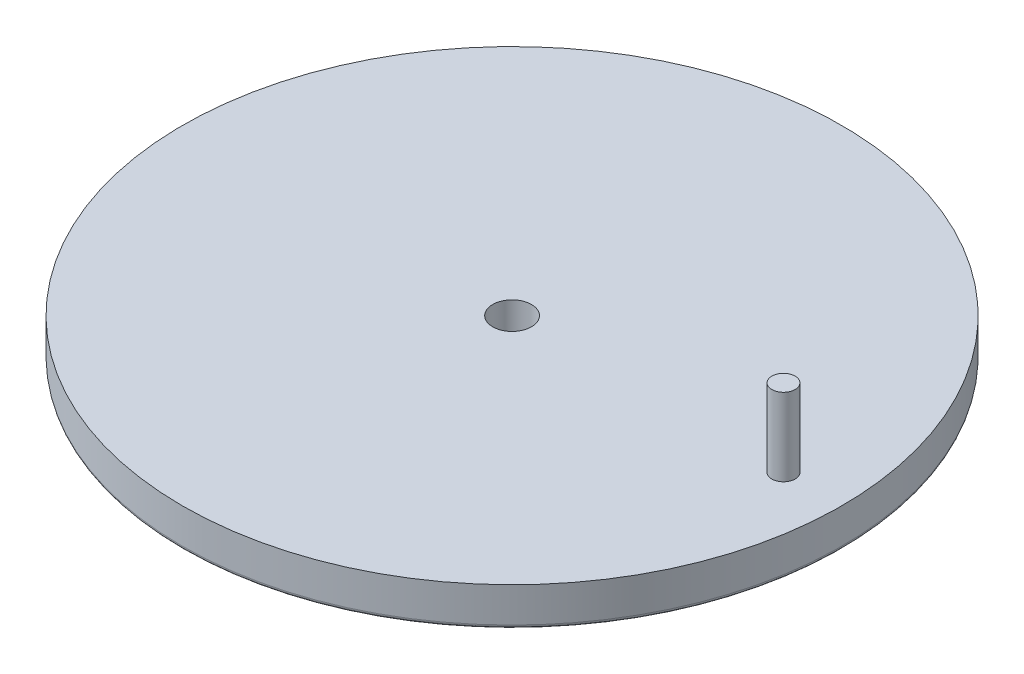
ISO-10303-21;
HEADER;
FILE_DESCRIPTION(('STEP AP214'),'2;1');
FILE_NAME('part.step','',(''),(''),'','','');
FILE_SCHEMA(('AUTOMOTIVE_DESIGN { 1 0 10303 214 1 1 1 1 }'));
ENDSEC;
DATA;
#1=APPLICATION_CONTEXT('core data for automotive mechanical design processes');
#2=APPLICATION_PROTOCOL_DEFINITION('international standard','automotive_design',2000,#1);
#3=PRODUCT_CONTEXT('',#1,'mechanical');
#4=PRODUCT('Part','Part','',(#3));
#5=PRODUCT_RELATED_PRODUCT_CATEGORY('part','',(#4));
#6=PRODUCT_DEFINITION_FORMATION('','',#4);
#7=PRODUCT_DEFINITION_CONTEXT('part definition',#1,'design');
#8=PRODUCT_DEFINITION('design','',#6,#7);
#9=PRODUCT_DEFINITION_SHAPE('','',#8);
#10=(LENGTH_UNIT() NAMED_UNIT(*) SI_UNIT(.MILLI.,.METRE.));
#11=(NAMED_UNIT(*) PLANE_ANGLE_UNIT() SI_UNIT($,.RADIAN.));
#12=(NAMED_UNIT(*) SI_UNIT($,.STERADIAN.) SOLID_ANGLE_UNIT());
#13=UNCERTAINTY_MEASURE_WITH_UNIT(LENGTH_MEASURE(1.E-05),#10,'distance_accuracy_value','');
#14=(GEOMETRIC_REPRESENTATION_CONTEXT(3) GLOBAL_UNCERTAINTY_ASSIGNED_CONTEXT((#13)) GLOBAL_UNIT_ASSIGNED_CONTEXT((#10,
#11,#12)) REPRESENTATION_CONTEXT('',''));
#15=CARTESIAN_POINT('',(0.,0.,0.));
#16=DIRECTION('',(0.,0.,1.));
#17=DIRECTION('',(1.,0.,0.));
#18=AXIS2_PLACEMENT_3D('',#15,#16,#17);
#19=CARTESIAN_POINT('',(0.,5.,0.));
#20=DIRECTION('',(0.,-1.,0.));
#21=DIRECTION('',(0.,0.,-1.));
#22=AXIS2_PLACEMENT_3D('',#19,#20,#21);
#23=CYLINDRICAL_SURFACE('',#22,42.5);
#24=CARTESIAN_POINT('',(0.,0.5,0.));
#25=DIRECTION('',(0.,1.,0.));
#26=DIRECTION('',(0.,0.,1.));
#27=AXIS2_PLACEMENT_3D('',#24,#25,#26);
#28=CIRCLE('',#27,42.5);
#29=CARTESIAN_POINT('',(0.,0.5,42.5));
#30=VERTEX_POINT('',#29);
#31=EDGE_CURVE('E43',#30,#30,#28,.T.);
#32=ORIENTED_EDGE('',*,*,#31,.T.);
#33=EDGE_LOOP('',(#32));
#34=FACE_BOUND('',#33,.T.);
#35=CARTESIAN_POINT('',(0.,5.,0.));
#36=DIRECTION('',(0.,1.,0.));
#37=DIRECTION('',(0.,0.,1.));
#38=AXIS2_PLACEMENT_3D('',#35,#36,#37);
#39=CIRCLE('',#38,42.5);
#40=CARTESIAN_POINT('',(0.,5.,42.5));
#41=VERTEX_POINT('',#40);
#42=EDGE_CURVE('E51',#41,#41,#39,.T.);
#43=ORIENTED_EDGE('',*,*,#42,.F.);
#44=EDGE_LOOP('',(#43));
#45=FACE_BOUND('',#44,.T.);
#46=ADVANCED_FACE('F36',(#34,#45),#23,.T.);
#47=CARTESIAN_POINT('',(0.,5.,0.));
#48=DIRECTION('',(0.,1.,0.));
#49=DIRECTION('',(0.,0.,1.));
#50=AXIS2_PLACEMENT_3D('',#47,#48,#49);
#51=PLANE('',#50);
#52=CARTESIAN_POINT('',(0.,5.,0.));
#53=DIRECTION('',(0.,1.,0.));
#54=DIRECTION('',(0.,0.,1.));
#55=AXIS2_PLACEMENT_3D('',#52,#53,#54);
#56=CIRCLE('',#55,2.5);
#57=CARTESIAN_POINT('',(0.,5.,2.5));
#58=VERTEX_POINT('',#57);
#59=EDGE_CURVE('E58',#58,#58,#56,.T.);
#60=ORIENTED_EDGE('',*,*,#59,.F.);
#61=EDGE_LOOP('',(#60));
#62=FACE_BOUND('',#61,.T.);
#63=CARTESIAN_POINT('',(35.,5.,0.));
#64=DIRECTION('',(0.,1.,0.));
#65=DIRECTION('',(0.,0.,1.));
#66=AXIS2_PLACEMENT_3D('',#63,#64,#65);
#67=CIRCLE('',#66,1.5);
#68=CARTESIAN_POINT('',(35.,5.,1.5));
#69=VERTEX_POINT('',#68);
#70=EDGE_CURVE('E57',#69,#69,#67,.T.);
#71=ORIENTED_EDGE('',*,*,#70,.F.);
#72=EDGE_LOOP('',(#71));
#73=FACE_BOUND('',#72,.T.);
#74=ORIENTED_EDGE('',*,*,#42,.T.);
#75=EDGE_LOOP('',(#74));
#76=FACE_BOUND('',#75,.T.);
#77=ADVANCED_FACE('F85',(#62,#73,#76),#51,.T.);
#78=CARTESIAN_POINT('',(0.,0.,0.));
#79=DIRECTION('',(0.,1.,0.));
#80=DIRECTION('',(0.,0.,1.));
#81=AXIS2_PLACEMENT_3D('',#78,#79,#80);
#82=PLANE('',#81);
#83=CARTESIAN_POINT('',(0.,0.,0.));
#84=DIRECTION('',(0.,1.,0.));
#85=DIRECTION('',(0.,0.,1.));
#86=AXIS2_PLACEMENT_3D('',#83,#84,#85);
#87=CIRCLE('',#86,42.);
#88=CARTESIAN_POINT('',(0.,0.,42.));
#89=VERTEX_POINT('',#88);
#90=EDGE_CURVE('E10',#89,#89,#87,.F.);
#91=ORIENTED_EDGE('',*,*,#90,.T.);
#92=EDGE_LOOP('',(#91));
#93=FACE_BOUND('',#92,.T.);
#94=CARTESIAN_POINT('',(0.,0.,-35.));
#95=DIRECTION('',(0.,1.,0.));
#96=DIRECTION('',(0.,0.,1.));
#97=AXIS2_PLACEMENT_3D('',#94,#95,#96);
#98=CIRCLE('',#97,5.);
#99=CARTESIAN_POINT('',(0.,0.,-30.));
#100=VERTEX_POINT('',#99);
#101=EDGE_CURVE('E47',#100,#100,#98,.F.);
#102=ORIENTED_EDGE('',*,*,#101,.F.);
#103=EDGE_LOOP('',(#102));
#104=FACE_BOUND('',#103,.T.);
#105=CARTESIAN_POINT('',(0.,0.,0.));
#106=DIRECTION('',(0.,1.,0.));
#107=DIRECTION('',(0.,0.,1.));
#108=AXIS2_PLACEMENT_3D('',#105,#106,#107);
#109=CIRCLE('',#108,2.5);
#110=CARTESIAN_POINT('',(0.,0.,2.5));
#111=VERTEX_POINT('',#110);
#112=EDGE_CURVE('E54',#111,#111,#109,.T.);
#113=ORIENTED_EDGE('',*,*,#112,.T.);
#114=EDGE_LOOP('',(#113));
#115=FACE_BOUND('',#114,.T.);
#116=ADVANCED_FACE('F81',(#93,#104,#115),#82,.F.);
#117=CARTESIAN_POINT('',(35.,15.,0.));
#118=DIRECTION('',(0.,-1.,0.));
#119=DIRECTION('',(0.,0.,-1.));
#120=AXIS2_PLACEMENT_3D('',#117,#118,#119);
#121=CYLINDRICAL_SURFACE('',#120,1.5);
#122=CARTESIAN_POINT('',(35.,15.,0.));
#123=DIRECTION('',(0.,1.,0.));
#124=DIRECTION('',(0.,0.,1.));
#125=AXIS2_PLACEMENT_3D('',#122,#123,#124);
#126=CIRCLE('',#125,1.5);
#127=CARTESIAN_POINT('',(35.,15.,1.5));
#128=VERTEX_POINT('',#127);
#129=EDGE_CURVE('E61',#128,#128,#126,.T.);
#130=ORIENTED_EDGE('',*,*,#129,.F.);
#131=EDGE_LOOP('',(#130));
#132=FACE_BOUND('',#131,.T.);
#133=ORIENTED_EDGE('',*,*,#70,.T.);
#134=EDGE_LOOP('',(#133));
#135=FACE_BOUND('',#134,.T.);
#136=ADVANCED_FACE('F84',(#132,#135),#121,.T.);
#137=CARTESIAN_POINT('',(35.,15.,0.));
#138=DIRECTION('',(0.,1.,0.));
#139=DIRECTION('',(0.,0.,1.));
#140=AXIS2_PLACEMENT_3D('',#137,#138,#139);
#141=PLANE('',#140);
#142=ORIENTED_EDGE('',*,*,#129,.T.);
#143=EDGE_LOOP('',(#142));
#144=FACE_BOUND('',#143,.T.);
#145=ADVANCED_FACE('F90',(#144),#141,.T.);
#146=CARTESIAN_POINT('',(0.,-5.,0.));
#147=DIRECTION('',(0.,1.,0.));
#148=DIRECTION('',(0.,0.,1.));
#149=AXIS2_PLACEMENT_3D('',#146,#147,#148);
#150=CYLINDRICAL_SURFACE('',#149,2.5);
#151=ORIENTED_EDGE('',*,*,#59,.T.);
#152=EDGE_LOOP('',(#151));
#153=FACE_BOUND('',#152,.T.);
#154=ORIENTED_EDGE('',*,*,#112,.F.);
#155=EDGE_LOOP('',(#154));
#156=FACE_BOUND('',#155,.T.);
#157=ADVANCED_FACE('F77',(#153,#156),#150,.F.);
#158=CARTESIAN_POINT('',(0.,-10.,-35.));
#159=DIRECTION('',(0.,1.,0.));
#160=DIRECTION('',(0.,0.,1.));
#161=AXIS2_PLACEMENT_3D('',#158,#159,#160);
#162=CYLINDRICAL_SURFACE('',#161,5.);
#163=CARTESIAN_POINT('',(0.,-10.,-35.));
#164=DIRECTION('',(0.,-1.,0.));
#165=DIRECTION('',(0.,0.,-1.));
#166=AXIS2_PLACEMENT_3D('',#163,#164,#165);
#167=CIRCLE('',#166,5.);
#168=CARTESIAN_POINT('',(0.,-10.,-40.));
#169=VERTEX_POINT('',#168);
#170=EDGE_CURVE('E68',#169,#169,#167,.T.);
#171=ORIENTED_EDGE('',*,*,#170,.F.);
#172=EDGE_LOOP('',(#171));
#173=FACE_BOUND('',#172,.T.);
#174=ORIENTED_EDGE('',*,*,#101,.T.);
#175=EDGE_LOOP('',(#174));
#176=FACE_BOUND('',#175,.T.);
#177=ADVANCED_FACE('F74',(#173,#176),#162,.T.);
#178=CARTESIAN_POINT('',(0.,-10.,-35.));
#179=DIRECTION('',(0.,-1.,0.));
#180=DIRECTION('',(0.,0.,-1.));
#181=AXIS2_PLACEMENT_3D('',#178,#179,#180);
#182=PLANE('',#181);
#183=ORIENTED_EDGE('',*,*,#170,.T.);
#184=EDGE_LOOP('',(#183));
#185=FACE_BOUND('',#184,.T.);
#186=ADVANCED_FACE('F72',(#185),#182,.T.);
#187=CARTESIAN_POINT('',(0.,0.5,0.));
#188=DIRECTION('',(0.,1.,0.));
#189=DIRECTION('',(0.,0.,1.));
#190=AXIS2_PLACEMENT_3D('',#187,#188,#189);
#191=TOROIDAL_SURFACE('',#190,42.,0.5);
#192=ORIENTED_EDGE('',*,*,#90,.F.);
#193=EDGE_LOOP('',(#192));
#194=FACE_BOUND('',#193,.T.);
#195=ORIENTED_EDGE('',*,*,#31,.F.);
#196=EDGE_LOOP('',(#195));
#197=FACE_BOUND('',#196,.T.);
#198=ADVANCED_FACE('F38',(#194,#197),#191,.T.);
#199=CLOSED_SHELL('',(#46,#77,#116,#136,#145,#157,#177,#186,#198));
#200=MANIFOLD_SOLID_BREP('B2',#199);
#201=ADVANCED_BREP_SHAPE_REPRESENTATION('',(#18,#200),#14);
#202=SHAPE_DEFINITION_REPRESENTATION(#9,#201);
ENDSEC;
END-ISO-10303-21;
